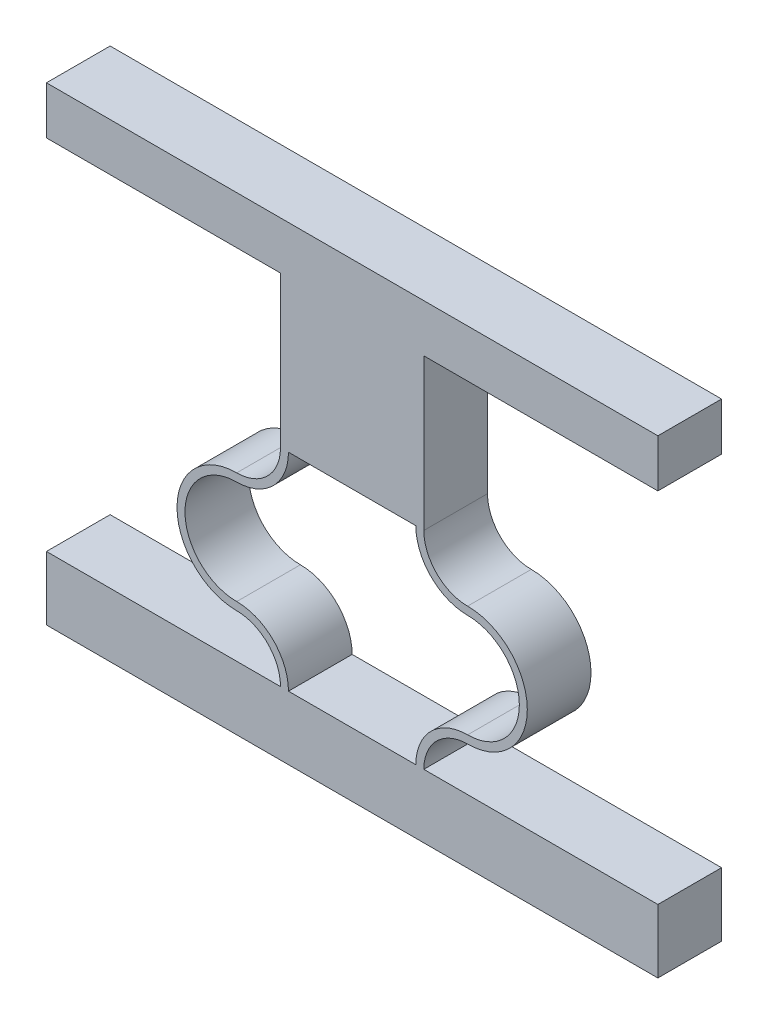
ISO-10303-21;
HEADER;
FILE_DESCRIPTION(('STEP AP214'),'2;1');
FILE_NAME('part.step','',(''),(''),'','','');
FILE_SCHEMA(('AUTOMOTIVE_DESIGN { 1 0 10303 214 1 1 1 1 }'));
ENDSEC;
DATA;
#1=APPLICATION_CONTEXT('core data for automotive mechanical design processes');
#2=APPLICATION_PROTOCOL_DEFINITION('international standard','automotive_design',2000,#1);
#3=PRODUCT_CONTEXT('',#1,'mechanical');
#4=PRODUCT('Part','Part','',(#3));
#5=PRODUCT_RELATED_PRODUCT_CATEGORY('part','',(#4));
#6=PRODUCT_DEFINITION_FORMATION('','',#4);
#7=PRODUCT_DEFINITION_CONTEXT('part definition',#1,'design');
#8=PRODUCT_DEFINITION('design','',#6,#7);
#9=PRODUCT_DEFINITION_SHAPE('','',#8);
#10=(LENGTH_UNIT() NAMED_UNIT(*) SI_UNIT(.MILLI.,.METRE.));
#11=(NAMED_UNIT(*) PLANE_ANGLE_UNIT() SI_UNIT($,.RADIAN.));
#12=(NAMED_UNIT(*) SI_UNIT($,.STERADIAN.) SOLID_ANGLE_UNIT());
#13=UNCERTAINTY_MEASURE_WITH_UNIT(LENGTH_MEASURE(1.E-05),#10,'distance_accuracy_value','');
#14=(GEOMETRIC_REPRESENTATION_CONTEXT(3) GLOBAL_UNCERTAINTY_ASSIGNED_CONTEXT((#13)) GLOBAL_UNIT_ASSIGNED_CONTEXT((#10,
#11,#12)) REPRESENTATION_CONTEXT('',''));
#15=CARTESIAN_POINT('',(0.,0.,0.));
#16=DIRECTION('',(0.,0.,1.));
#17=DIRECTION('',(1.,0.,0.));
#18=AXIS2_PLACEMENT_3D('',#15,#16,#17);
#19=CARTESIAN_POINT('',(13.4499998963409,13.,4.));
#20=DIRECTION('',(0.,0.,-1.));
#21=DIRECTION('',(-1.,0.,0.));
#22=AXIS2_PLACEMENT_3D('',#19,#20,#21);
#23=CYLINDRICAL_SURFACE('',#22,3.25);
#24=CARTESIAN_POINT('',(13.4499998963409,13.,0.));
#25=DIRECTION('',(0.,0.,1.));
#26=DIRECTION('',(1.,0.,0.));
#27=AXIS2_PLACEMENT_3D('',#24,#25,#26);
#28=CIRCLE('',#27,3.25);
#29=CARTESIAN_POINT('',(10.1999998963409,13.,0.));
#30=VERTEX_POINT('',#29);
#31=CARTESIAN_POINT('',(13.4499998963409,9.75,0.));
#32=VERTEX_POINT('',#31);
#33=EDGE_CURVE('E168',#30,#32,#28,.T.);
#34=ORIENTED_EDGE('',*,*,#33,.T.);
#35=DIRECTION('',(0.,0.,-1.));
#36=VECTOR('',#35,1.);
#37=CARTESIAN_POINT('',(13.4499998963409,9.75,4.));
#38=LINE('',#37,#36);
#39=CARTESIAN_POINT('',(13.4499998963409,9.75,4.));
#40=VERTEX_POINT('',#39);
#41=EDGE_CURVE('E152',#40,#32,#38,.T.);
#42=ORIENTED_EDGE('',*,*,#41,.F.);
#43=CARTESIAN_POINT('',(13.4499998963409,13.,4.));
#44=DIRECTION('',(0.,0.,1.));
#45=DIRECTION('',(1.,0.,0.));
#46=AXIS2_PLACEMENT_3D('',#43,#44,#45);
#47=CIRCLE('',#46,3.25);
#48=CARTESIAN_POINT('',(10.1999998963409,13.,4.));
#49=VERTEX_POINT('',#48);
#50=EDGE_CURVE('E156',#49,#40,#47,.T.);
#51=ORIENTED_EDGE('',*,*,#50,.F.);
#52=DIRECTION('',(0.,0.,-1.));
#53=VECTOR('',#52,1.);
#54=CARTESIAN_POINT('',(10.1999998963409,13.,4.));
#55=LINE('',#54,#53);
#56=EDGE_CURVE('E169',#49,#30,#55,.T.);
#57=ORIENTED_EDGE('',*,*,#56,.T.);
#58=EDGE_LOOP('',(#34,#42,#51,#57));
#59=FACE_BOUND('',#58,.T.);
#60=ADVANCED_FACE('F43',(#59),#23,.T.);
#61=CARTESIAN_POINT('',(13.4499998963409,6.5,4.));
#62=DIRECTION('',(0.,0.,-1.));
#63=DIRECTION('',(-1.,0.,0.));
#64=AXIS2_PLACEMENT_3D('',#61,#62,#63);
#65=CYLINDRICAL_SURFACE('',#64,3.25);
#66=CARTESIAN_POINT('',(13.4499998963409,6.5,0.));
#67=DIRECTION('',(0.,0.,1.));
#68=DIRECTION('',(1.,0.,0.));
#69=AXIS2_PLACEMENT_3D('',#66,#67,#68);
#70=CIRCLE('',#69,3.25);
#71=CARTESIAN_POINT('',(13.4499998963409,3.25,0.));
#72=VERTEX_POINT('',#71);
#73=EDGE_CURVE('E206',#32,#72,#70,.F.);
#74=ORIENTED_EDGE('',*,*,#73,.T.);
#75=DIRECTION('',(0.,0.,-1.));
#76=VECTOR('',#75,1.);
#77=CARTESIAN_POINT('',(13.4499998963409,3.25,4.));
#78=LINE('',#77,#76);
#79=CARTESIAN_POINT('',(13.4499998963409,3.25,4.));
#80=VERTEX_POINT('',#79);
#81=EDGE_CURVE('E154',#80,#72,#78,.T.);
#82=ORIENTED_EDGE('',*,*,#81,.F.);
#83=CARTESIAN_POINT('',(13.4499998963409,6.5,4.));
#84=DIRECTION('',(0.,0.,1.));
#85=DIRECTION('',(1.,0.,0.));
#86=AXIS2_PLACEMENT_3D('',#83,#84,#85);
#87=CIRCLE('',#86,3.25);
#88=EDGE_CURVE('E147',#40,#80,#87,.F.);
#89=ORIENTED_EDGE('',*,*,#88,.F.);
#90=ORIENTED_EDGE('',*,*,#41,.T.);
#91=EDGE_LOOP('',(#74,#82,#89,#90));
#92=FACE_BOUND('',#91,.T.);
#93=ADVANCED_FACE('F150',(#92),#65,.F.);
#94=CARTESIAN_POINT('',(13.4499998963409,0.,4.));
#95=DIRECTION('',(0.,0.,-1.));
#96=DIRECTION('',(-1.,0.,0.));
#97=AXIS2_PLACEMENT_3D('',#94,#95,#96);
#98=CYLINDRICAL_SURFACE('',#97,3.25);
#99=CARTESIAN_POINT('',(13.4499998963409,0.,0.));
#100=DIRECTION('',(0.,0.,1.));
#101=DIRECTION('',(1.,0.,0.));
#102=AXIS2_PLACEMENT_3D('',#99,#100,#101);
#103=CIRCLE('',#102,3.25);
#104=CARTESIAN_POINT('',(10.1999998963409,0.,0.));
#105=VERTEX_POINT('',#104);
#106=EDGE_CURVE('E204',#72,#105,#103,.T.);
#107=ORIENTED_EDGE('',*,*,#106,.T.);
#108=DIRECTION('',(0.,0.,-1.));
#109=VECTOR('',#108,1.);
#110=CARTESIAN_POINT('',(10.1999998963409,0.,4.));
#111=LINE('',#110,#109);
#112=CARTESIAN_POINT('',(10.1999998963409,0.,4.));
#113=VERTEX_POINT('',#112);
#114=EDGE_CURVE('E190',#113,#105,#111,.T.);
#115=ORIENTED_EDGE('',*,*,#114,.F.);
#116=CARTESIAN_POINT('',(13.4499998963409,0.,4.));
#117=DIRECTION('',(0.,0.,1.));
#118=DIRECTION('',(1.,0.,0.));
#119=AXIS2_PLACEMENT_3D('',#116,#117,#118);
#120=CIRCLE('',#119,3.25);
#121=EDGE_CURVE('E141',#80,#113,#120,.T.);
#122=ORIENTED_EDGE('',*,*,#121,.F.);
#123=ORIENTED_EDGE('',*,*,#81,.T.);
#124=EDGE_LOOP('',(#107,#115,#122,#123));
#125=FACE_BOUND('',#124,.T.);
#126=ADVANCED_FACE('F373',(#125),#98,.T.);
#127=CARTESIAN_POINT('',(0.,-4.00000000000024,4.));
#128=DIRECTION('',(0.,1.,0.));
#129=DIRECTION('',(-1.,0.,0.));
#130=AXIS2_PLACEMENT_3D('',#127,#128,#129);
#131=PLANE('',#130);
#132=DIRECTION('',(1.,0.,0.));
#133=VECTOR('',#132,1.);
#134=CARTESIAN_POINT('',(0.,-4.00000000000024,4.));
#135=LINE('',#134,#133);
#136=CARTESIAN_POINT('',(-13.0000002126815,-4.00000000000024,4.));
#137=VERTEX_POINT('',#136);
#138=CARTESIAN_POINT('',(25.4000000053633,-4.00000000000024,4.));
#139=VERTEX_POINT('',#138);
#140=EDGE_CURVE('E213',#137,#139,#135,.T.);
#141=ORIENTED_EDGE('',*,*,#140,.F.);
#142=DIRECTION('',(0.,0.,-1.));
#143=VECTOR('',#142,1.);
#144=CARTESIAN_POINT('',(-13.0000002126815,-4.00000000000024,4.));
#145=LINE('',#144,#143);
#146=CARTESIAN_POINT('',(-13.0000002126815,-4.00000000000024,0.));
#147=VERTEX_POINT('',#146);
#148=EDGE_CURVE('E239',#137,#147,#145,.T.);
#149=ORIENTED_EDGE('',*,*,#148,.T.);
#150=DIRECTION('',(1.,0.,0.));
#151=VECTOR('',#150,1.);
#152=CARTESIAN_POINT('',(0.,-4.00000000000024,0.));
#153=LINE('',#152,#151);
#154=CARTESIAN_POINT('',(25.4000000053633,-4.00000000000024,0.));
#155=VERTEX_POINT('',#154);
#156=EDGE_CURVE('E194',#147,#155,#153,.T.);
#157=ORIENTED_EDGE('',*,*,#156,.T.);
#158=DIRECTION('',(0.,0.,-1.));
#159=VECTOR('',#158,1.);
#160=CARTESIAN_POINT('',(25.4000000053633,-4.00000000000024,4.));
#161=LINE('',#160,#159);
#162=EDGE_CURVE('E183',#139,#155,#161,.T.);
#163=ORIENTED_EDGE('',*,*,#162,.F.);
#164=EDGE_LOOP('',(#141,#149,#157,#163));
#165=FACE_BOUND('',#164,.T.);
#166=ADVANCED_FACE('F236',(#165),#131,.F.);
#167=CARTESIAN_POINT('',(25.4000000053633,0.,4.));
#168=DIRECTION('',(-1.,0.,0.));
#169=DIRECTION('',(0.,-1.,0.));
#170=AXIS2_PLACEMENT_3D('',#167,#168,#169);
#171=PLANE('',#170);
#172=DIRECTION('',(0.,1.,0.));
#173=VECTOR('',#172,1.);
#174=CARTESIAN_POINT('',(25.4000000053633,0.,0.));
#175=LINE('',#174,#173);
#176=CARTESIAN_POINT('',(25.4000000053633,0.,0.));
#177=VERTEX_POINT('',#176);
#178=EDGE_CURVE('E191',#155,#177,#175,.T.);
#179=ORIENTED_EDGE('',*,*,#178,.T.);
#180=DIRECTION('',(0.,0.,1.));
#181=VECTOR('',#180,1.);
#182=CARTESIAN_POINT('',(25.4000000053633,0.,0.));
#183=LINE('',#182,#181);
#184=CARTESIAN_POINT('',(25.4000000053633,0.,4.));
#185=VERTEX_POINT('',#184);
#186=EDGE_CURVE('E248',#177,#185,#183,.T.);
#187=ORIENTED_EDGE('',*,*,#186,.T.);
#188=DIRECTION('',(0.,1.,0.));
#189=VECTOR('',#188,1.);
#190=CARTESIAN_POINT('',(25.4000000053633,0.,4.));
#191=LINE('',#190,#189);
#192=EDGE_CURVE('E171',#139,#185,#191,.T.);
#193=ORIENTED_EDGE('',*,*,#192,.F.);
#194=ORIENTED_EDGE('',*,*,#162,.T.);
#195=EDGE_LOOP('',(#179,#187,#193,#194));
#196=FACE_BOUND('',#195,.T.);
#197=ADVANCED_FACE('F246',(#196),#171,.F.);
#198=CARTESIAN_POINT('',(10.7000142238188,0.,4.));
#199=DIRECTION('',(-1.,0.,0.));
#200=DIRECTION('',(0.,-1.,0.));
#201=AXIS2_PLACEMENT_3D('',#198,#199,#200);
#202=PLANE('',#201);
#203=DIRECTION('',(0.,1.,0.));
#204=VECTOR('',#203,1.);
#205=CARTESIAN_POINT('',(10.7000142238188,0.,0.));
#206=LINE('',#205,#204);
#207=CARTESIAN_POINT('',(10.7000142238188,12.9911230115913,0.));
#208=VERTEX_POINT('',#207);
#209=CARTESIAN_POINT('',(10.7000142238188,22.4911230115913,0.));
#210=VERTEX_POINT('',#209);
#211=EDGE_CURVE('E52',#208,#210,#206,.T.);
#212=ORIENTED_EDGE('',*,*,#211,.T.);
#213=DIRECTION('',(0.,0.,-1.));
#214=VECTOR('',#213,1.);
#215=CARTESIAN_POINT('',(10.7000142238188,22.4911230115913,4.));
#216=LINE('',#215,#214);
#217=CARTESIAN_POINT('',(10.7000142238188,22.4911230115913,4.));
#218=VERTEX_POINT('',#217);
#219=EDGE_CURVE('E13',#218,#210,#216,.T.);
#220=ORIENTED_EDGE('',*,*,#219,.F.);
#221=DIRECTION('',(0.,1.,0.));
#222=VECTOR('',#221,1.);
#223=CARTESIAN_POINT('',(10.7000142238188,0.,4.));
#224=LINE('',#223,#222);
#225=CARTESIAN_POINT('',(10.7000142238188,12.9911230115913,4.));
#226=VERTEX_POINT('',#225);
#227=EDGE_CURVE('E68',#226,#218,#224,.T.);
#228=ORIENTED_EDGE('',*,*,#227,.F.);
#229=DIRECTION('',(0.,0.,-1.));
#230=VECTOR('',#229,1.);
#231=CARTESIAN_POINT('',(10.7000142238188,12.9911230115913,4.));
#232=LINE('',#231,#230);
#233=EDGE_CURVE('E179',#226,#208,#232,.T.);
#234=ORIENTED_EDGE('',*,*,#233,.T.);
#235=EDGE_LOOP('',(#212,#220,#228,#234));
#236=FACE_BOUND('',#235,.T.);
#237=ADVANCED_FACE('F492',(#236),#202,.F.);
#238=CARTESIAN_POINT('',(0.,0.,4.));
#239=DIRECTION('',(0.,1.,0.));
#240=DIRECTION('',(-1.,0.,0.));
#241=AXIS2_PLACEMENT_3D('',#238,#239,#240);
#242=PLANE('',#241);
#243=DIRECTION('',(1.,0.,0.));
#244=VECTOR('',#243,1.);
#245=CARTESIAN_POINT('',(0.,0.,0.));
#246=LINE('',#245,#244);
#247=CARTESIAN_POINT('',(10.6999998963409,0.,0.));
#248=VERTEX_POINT('',#247);
#249=EDGE_CURVE('E59',#248,#177,#246,.T.);
#250=ORIENTED_EDGE('',*,*,#249,.F.);
#251=DIRECTION('',(0.,0.,-1.));
#252=VECTOR('',#251,1.);
#253=CARTESIAN_POINT('',(10.6999998963409,0.,4.));
#254=LINE('',#253,#252);
#255=CARTESIAN_POINT('',(10.6999998963409,0.,4.));
#256=VERTEX_POINT('',#255);
#257=EDGE_CURVE('E182',#256,#248,#254,.T.);
#258=ORIENTED_EDGE('',*,*,#257,.F.);
#259=DIRECTION('',(1.,0.,0.));
#260=VECTOR('',#259,1.);
#261=CARTESIAN_POINT('',(0.,0.,4.));
#262=LINE('',#261,#260);
#263=EDGE_CURVE('E220',#256,#185,#262,.T.);
#264=ORIENTED_EDGE('',*,*,#263,.T.);
#265=ORIENTED_EDGE('',*,*,#186,.F.);
#266=EDGE_LOOP('',(#250,#258,#264,#265));
#267=FACE_BOUND('',#266,.T.);
#268=ADVANCED_FACE('F503',(#267),#242,.T.);
#269=CARTESIAN_POINT('',(13.4499998963409,0.,4.));
#270=DIRECTION('',(0.,0.,-1.));
#271=DIRECTION('',(-1.,0.,0.));
#272=AXIS2_PLACEMENT_3D('',#269,#270,#271);
#273=CYLINDRICAL_SURFACE('',#272,2.75);
#274=CARTESIAN_POINT('',(13.4499998963409,0.,0.));
#275=DIRECTION('',(0.,0.,1.));
#276=DIRECTION('',(1.,0.,0.));
#277=AXIS2_PLACEMENT_3D('',#274,#275,#276);
#278=CIRCLE('',#277,2.75);
#279=CARTESIAN_POINT('',(13.4499998963409,2.75,0.));
#280=VERTEX_POINT('',#279);
#281=EDGE_CURVE('E198',#280,#248,#278,.T.);
#282=ORIENTED_EDGE('',*,*,#281,.F.);
#283=DIRECTION('',(0.,0.,-1.));
#284=VECTOR('',#283,1.);
#285=CARTESIAN_POINT('',(13.4499998963409,2.75,4.));
#286=LINE('',#285,#284);
#287=CARTESIAN_POINT('',(13.4499998963409,2.75,4.));
#288=VERTEX_POINT('',#287);
#289=EDGE_CURVE('E185',#288,#280,#286,.T.);
#290=ORIENTED_EDGE('',*,*,#289,.F.);
#291=CARTESIAN_POINT('',(13.4499998963409,0.,4.));
#292=DIRECTION('',(0.,0.,1.));
#293=DIRECTION('',(1.,0.,0.));
#294=AXIS2_PLACEMENT_3D('',#291,#292,#293);
#295=CIRCLE('',#294,2.75);
#296=EDGE_CURVE('E217',#288,#256,#295,.T.);
#297=ORIENTED_EDGE('',*,*,#296,.T.);
#298=ORIENTED_EDGE('',*,*,#257,.T.);
#299=EDGE_LOOP('',(#282,#290,#297,#298));
#300=FACE_BOUND('',#299,.T.);
#301=ADVANCED_FACE('F502',(#300),#273,.F.);
#302=CARTESIAN_POINT('',(13.4499998963409,6.5,4.));
#303=DIRECTION('',(0.,0.,-1.));
#304=DIRECTION('',(-1.,0.,0.));
#305=AXIS2_PLACEMENT_3D('',#302,#303,#304);
#306=CYLINDRICAL_SURFACE('',#305,3.75);
#307=CARTESIAN_POINT('',(13.4499998963409,6.5,0.));
#308=DIRECTION('',(0.,0.,1.));
#309=DIRECTION('',(1.,0.,0.));
#310=AXIS2_PLACEMENT_3D('',#307,#308,#309);
#311=CIRCLE('',#310,3.75);
#312=CARTESIAN_POINT('',(13.4499998963409,10.25,0.));
#313=VERTEX_POINT('',#312);
#314=EDGE_CURVE('E195',#313,#280,#311,.F.);
#315=ORIENTED_EDGE('',*,*,#314,.F.);
#316=DIRECTION('',(0.,0.,-1.));
#317=VECTOR('',#316,1.);
#318=CARTESIAN_POINT('',(13.4499998963409,10.25,4.));
#319=LINE('',#318,#317);
#320=CARTESIAN_POINT('',(13.4499998963409,10.25,4.));
#321=VERTEX_POINT('',#320);
#322=EDGE_CURVE('E173',#321,#313,#319,.T.);
#323=ORIENTED_EDGE('',*,*,#322,.F.);
#324=CARTESIAN_POINT('',(13.4499998963409,6.5,4.));
#325=DIRECTION('',(0.,0.,1.));
#326=DIRECTION('',(1.,0.,0.));
#327=AXIS2_PLACEMENT_3D('',#324,#325,#326);
#328=CIRCLE('',#327,3.75);
#329=EDGE_CURVE('E214',#321,#288,#328,.F.);
#330=ORIENTED_EDGE('',*,*,#329,.T.);
#331=ORIENTED_EDGE('',*,*,#289,.T.);
#332=EDGE_LOOP('',(#315,#323,#330,#331));
#333=FACE_BOUND('',#332,.T.);
#334=ADVANCED_FACE('F498',(#333),#306,.T.);
#335=CARTESIAN_POINT('',(13.4499998963409,13.,4.));
#336=DIRECTION('',(0.,0.,-1.));
#337=DIRECTION('',(-1.,0.,0.));
#338=AXIS2_PLACEMENT_3D('',#335,#336,#337);
#339=CYLINDRICAL_SURFACE('',#338,2.75);
#340=CARTESIAN_POINT('',(13.4499998963409,13.,0.));
#341=DIRECTION('',(0.,0.,1.));
#342=DIRECTION('',(1.,0.,0.));
#343=AXIS2_PLACEMENT_3D('',#340,#341,#342);
#344=CIRCLE('',#343,2.75);
#345=EDGE_CURVE('E201',#208,#313,#344,.T.);
#346=ORIENTED_EDGE('',*,*,#345,.F.);
#347=ORIENTED_EDGE('',*,*,#233,.F.);
#348=CARTESIAN_POINT('',(13.4499998963409,13.,4.));
#349=DIRECTION('',(0.,0.,1.));
#350=DIRECTION('',(1.,0.,0.));
#351=AXIS2_PLACEMENT_3D('',#348,#349,#350);
#352=CIRCLE('',#351,2.75);
#353=EDGE_CURVE('E223',#226,#321,#352,.T.);
#354=ORIENTED_EDGE('',*,*,#353,.T.);
#355=ORIENTED_EDGE('',*,*,#322,.T.);
#356=EDGE_LOOP('',(#346,#347,#354,#355));
#357=FACE_BOUND('',#356,.T.);
#358=ADVANCED_FACE('F522',(#357),#339,.F.);
#359=CARTESIAN_POINT('',(0.,0.,4.));
#360=DIRECTION('',(0.,0.,1.));
#361=DIRECTION('',(1.,0.,0.));
#362=AXIS2_PLACEMENT_3D('',#359,#360,#361);
#363=PLANE('',#362);
#364=DIRECTION('',(-1.,0.,0.));
#365=VECTOR('',#364,1.);
#366=CARTESIAN_POINT('',(12.3999997926818,0.,4.));
#367=LINE('',#366,#365);
#368=CARTESIAN_POINT('',(1.6999998963409,0.,4.));
#369=VERTEX_POINT('',#368);
#370=CARTESIAN_POINT('',(-13.0000002126814,0.,4.));
#371=VERTEX_POINT('',#370);
#372=EDGE_CURVE('E388',#369,#371,#367,.T.);
#373=ORIENTED_EDGE('',*,*,#372,.T.);
#374=DIRECTION('',(0.,1.,0.));
#375=VECTOR('',#374,1.);
#376=CARTESIAN_POINT('',(-13.0000002126815,0.,4.));
#377=LINE('',#376,#375);
#378=EDGE_CURVE('E381',#137,#371,#377,.T.);
#379=ORIENTED_EDGE('',*,*,#378,.F.);
#380=ORIENTED_EDGE('',*,*,#140,.T.);
#381=ORIENTED_EDGE('',*,*,#192,.T.);
#382=ORIENTED_EDGE('',*,*,#263,.F.);
#383=ORIENTED_EDGE('',*,*,#296,.F.);
#384=ORIENTED_EDGE('',*,*,#329,.F.);
#385=ORIENTED_EDGE('',*,*,#353,.F.);
#386=ORIENTED_EDGE('',*,*,#227,.T.);
#387=DIRECTION('',(1.,0.,0.));
#388=VECTOR('',#387,1.);
#389=CARTESIAN_POINT('',(-13.0000002126815,22.4911230115913,4.));
#390=LINE('',#389,#388);
#391=CARTESIAN_POINT('',(25.4000000053633,22.4911230115913,4.));
#392=VERTEX_POINT('',#391);
#393=EDGE_CURVE('E474',#218,#392,#390,.T.);
#394=ORIENTED_EDGE('',*,*,#393,.T.);
#395=DIRECTION('',(0.,1.,0.));
#396=VECTOR('',#395,1.);
#397=CARTESIAN_POINT('',(25.4000000053633,25.4911230115913,4.));
#398=LINE('',#397,#396);
#399=CARTESIAN_POINT('',(25.4000000053633,25.4911230115913,4.));
#400=VERTEX_POINT('',#399);
#401=EDGE_CURVE('E470',#392,#400,#398,.T.);
#402=ORIENTED_EDGE('',*,*,#401,.T.);
#403=DIRECTION('',(-1.,0.,0.));
#404=VECTOR('',#403,1.);
#405=CARTESIAN_POINT('',(-13.0000002126815,25.4911230115913,4.));
#406=LINE('',#405,#404);
#407=CARTESIAN_POINT('',(-13.0000002126815,25.4911230115913,4.));
#408=VERTEX_POINT('',#407);
#409=EDGE_CURVE('E460',#400,#408,#406,.T.);
#410=ORIENTED_EDGE('',*,*,#409,.T.);
#411=DIRECTION('',(0.,-1.,0.));
#412=VECTOR('',#411,1.);
#413=CARTESIAN_POINT('',(-13.0000002126815,25.4911230115913,4.));
#414=LINE('',#413,#412);
#415=CARTESIAN_POINT('',(-13.0000002126815,22.4911230115913,4.));
#416=VERTEX_POINT('',#415);
#417=EDGE_CURVE('E475',#408,#416,#414,.T.);
#418=ORIENTED_EDGE('',*,*,#417,.T.);
#419=CARTESIAN_POINT('',(1.69998556886301,22.4911230115913,4.));
#420=VERTEX_POINT('',#419);
#421=EDGE_CURVE('E442',#416,#420,#390,.T.);
#422=ORIENTED_EDGE('',*,*,#421,.T.);
#423=DIRECTION('',(0.,1.,0.));
#424=VECTOR('',#423,1.);
#425=CARTESIAN_POINT('',(1.69998556886302,0.,4.));
#426=LINE('',#425,#424);
#427=CARTESIAN_POINT('',(1.69998556886301,12.9911230116086,4.));
#428=VERTEX_POINT('',#427);
#429=EDGE_CURVE('E352',#428,#420,#426,.T.);
#430=ORIENTED_EDGE('',*,*,#429,.F.);
#431=CARTESIAN_POINT('',(-1.0500001036591,13.,4.));
#432=DIRECTION('',(0.,0.,-1.));
#433=DIRECTION('',(-1.,0.,0.));
#434=AXIS2_PLACEMENT_3D('',#431,#432,#433);
#435=CIRCLE('',#434,2.75);
#436=CARTESIAN_POINT('',(-1.0500001036591,10.25,4.));
#437=VERTEX_POINT('',#436);
#438=EDGE_CURVE('E390',#428,#437,#435,.T.);
#439=ORIENTED_EDGE('',*,*,#438,.T.);
#440=CARTESIAN_POINT('',(-1.0500001036591,6.5,4.));
#441=DIRECTION('',(0.,0.,-1.));
#442=DIRECTION('',(-1.,0.,0.));
#443=AXIS2_PLACEMENT_3D('',#440,#441,#442);
#444=CIRCLE('',#443,3.75);
#445=CARTESIAN_POINT('',(-1.0500001036591,2.75,4.));
#446=VERTEX_POINT('',#445);
#447=EDGE_CURVE('E384',#437,#446,#444,.F.);
#448=ORIENTED_EDGE('',*,*,#447,.T.);
#449=CARTESIAN_POINT('',(-1.0500001036591,0.,4.));
#450=DIRECTION('',(0.,0.,-1.));
#451=DIRECTION('',(-1.,0.,0.));
#452=AXIS2_PLACEMENT_3D('',#449,#450,#451);
#453=CIRCLE('',#452,2.75);
#454=EDGE_CURVE('E386',#446,#369,#453,.T.);
#455=ORIENTED_EDGE('',*,*,#454,.T.);
#456=EDGE_LOOP('',(#373,#379,#380,#381,#382,#383,#384,#385,#386,#394,#402,#410,#418,#422,#430,
#439,#448,#455));
#457=FACE_BOUND('',#456,.T.);
#458=DIRECTION('',(1.,0.,0.));
#459=VECTOR('',#458,1.);
#460=CARTESIAN_POINT('',(6.19999989634091,0.,4.));
#461=LINE('',#460,#459);
#462=CARTESIAN_POINT('',(2.19999989634091,0.,4.));
#463=VERTEX_POINT('',#462);
#464=EDGE_CURVE('E365',#463,#113,#461,.T.);
#465=ORIENTED_EDGE('',*,*,#464,.F.);
#466=CARTESIAN_POINT('',(-1.0500001036591,0.,4.));
#467=DIRECTION('',(0.,0.,-1.));
#468=DIRECTION('',(-1.,0.,0.));
#469=AXIS2_PLACEMENT_3D('',#466,#467,#468);
#470=CIRCLE('',#469,3.25);
#471=CARTESIAN_POINT('',(-1.0500001036591,3.25,4.));
#472=VERTEX_POINT('',#471);
#473=EDGE_CURVE('E329',#472,#463,#470,.T.);
#474=ORIENTED_EDGE('',*,*,#473,.F.);
#475=CARTESIAN_POINT('',(-1.0500001036591,6.5,4.));
#476=DIRECTION('',(0.,0.,-1.));
#477=DIRECTION('',(-1.,0.,0.));
#478=AXIS2_PLACEMENT_3D('',#475,#476,#477);
#479=CIRCLE('',#478,3.25);
#480=CARTESIAN_POINT('',(-1.0500001036591,9.75,4.));
#481=VERTEX_POINT('',#480);
#482=EDGE_CURVE('E332',#481,#472,#479,.F.);
#483=ORIENTED_EDGE('',*,*,#482,.F.);
#484=CARTESIAN_POINT('',(-1.0500001036591,13.,4.));
#485=DIRECTION('',(0.,0.,-1.));
#486=DIRECTION('',(-1.,0.,0.));
#487=AXIS2_PLACEMENT_3D('',#484,#485,#486);
#488=CIRCLE('',#487,3.25);
#489=CARTESIAN_POINT('',(2.19999989634091,13.,4.));
#490=VERTEX_POINT('',#489);
#491=EDGE_CURVE('E335',#490,#481,#488,.T.);
#492=ORIENTED_EDGE('',*,*,#491,.F.);
#493=DIRECTION('',(1.,0.,0.));
#494=VECTOR('',#493,1.);
#495=CARTESIAN_POINT('',(6.19999989634091,13.,4.));
#496=LINE('',#495,#494);
#497=EDGE_CURVE('E164',#490,#49,#496,.T.);
#498=ORIENTED_EDGE('',*,*,#497,.T.);
#499=ORIENTED_EDGE('',*,*,#50,.T.);
#500=ORIENTED_EDGE('',*,*,#88,.T.);
#501=ORIENTED_EDGE('',*,*,#121,.T.);
#502=EDGE_LOOP('',(#465,#474,#483,#492,#498,#499,#500,#501));
#503=FACE_BOUND('',#502,.T.);
#504=ADVANCED_FACE('F161',(#457,#503),#363,.T.);
#505=CARTESIAN_POINT('',(0.,0.,0.));
#506=DIRECTION('',(0.,0.,1.));
#507=DIRECTION('',(1.,0.,0.));
#508=AXIS2_PLACEMENT_3D('',#505,#506,#507);
#509=PLANE('',#508);
#510=DIRECTION('',(0.,1.,0.));
#511=VECTOR('',#510,1.);
#512=CARTESIAN_POINT('',(-13.0000002126815,0.,0.));
#513=LINE('',#512,#511);
#514=CARTESIAN_POINT('',(-13.0000002126814,0.,0.));
#515=VERTEX_POINT('',#514);
#516=EDGE_CURVE('E354',#147,#515,#513,.T.);
#517=ORIENTED_EDGE('',*,*,#516,.T.);
#518=DIRECTION('',(-1.,0.,0.));
#519=VECTOR('',#518,1.);
#520=CARTESIAN_POINT('',(12.3999997926818,0.,0.));
#521=LINE('',#520,#519);
#522=CARTESIAN_POINT('',(1.6999998963409,0.,0.));
#523=VERTEX_POINT('',#522);
#524=EDGE_CURVE('E413',#523,#515,#521,.T.);
#525=ORIENTED_EDGE('',*,*,#524,.F.);
#526=CARTESIAN_POINT('',(-1.0500001036591,0.,0.));
#527=DIRECTION('',(0.,0.,-1.));
#528=DIRECTION('',(-1.,0.,0.));
#529=AXIS2_PLACEMENT_3D('',#526,#527,#528);
#530=CIRCLE('',#529,2.75);
#531=CARTESIAN_POINT('',(-1.0500001036591,2.75,0.));
#532=VERTEX_POINT('',#531);
#533=EDGE_CURVE('E411',#532,#523,#530,.T.);
#534=ORIENTED_EDGE('',*,*,#533,.F.);
#535=CARTESIAN_POINT('',(-1.0500001036591,6.5,0.));
#536=DIRECTION('',(0.,0.,-1.));
#537=DIRECTION('',(-1.,0.,0.));
#538=AXIS2_PLACEMENT_3D('',#535,#536,#537);
#539=CIRCLE('',#538,3.75);
#540=CARTESIAN_POINT('',(-1.0500001036591,10.25,0.));
#541=VERTEX_POINT('',#540);
#542=EDGE_CURVE('E409',#541,#532,#539,.F.);
#543=ORIENTED_EDGE('',*,*,#542,.F.);
#544=CARTESIAN_POINT('',(-1.0500001036591,13.,0.));
#545=DIRECTION('',(0.,0.,-1.));
#546=DIRECTION('',(-1.,0.,0.));
#547=AXIS2_PLACEMENT_3D('',#544,#545,#546);
#548=CIRCLE('',#547,2.75);
#549=CARTESIAN_POINT('',(1.699985568863,12.9911230115913,0.));
#550=VERTEX_POINT('',#549);
#551=EDGE_CURVE('E416',#550,#541,#548,.T.);
#552=ORIENTED_EDGE('',*,*,#551,.F.);
#553=DIRECTION('',(0.,1.,0.));
#554=VECTOR('',#553,1.);
#555=CARTESIAN_POINT('',(1.69998556886302,0.,0.));
#556=LINE('',#555,#554);
#557=CARTESIAN_POINT('',(1.69998556886301,22.4911230115913,0.));
#558=VERTEX_POINT('',#557);
#559=EDGE_CURVE('E86',#550,#558,#556,.T.);
#560=ORIENTED_EDGE('',*,*,#559,.T.);
#561=DIRECTION('',(-1.,0.,0.));
#562=VECTOR('',#561,1.);
#563=CARTESIAN_POINT('',(-13.0000002126815,22.4911230115913,0.));
#564=LINE('',#563,#562);
#565=CARTESIAN_POINT('',(-13.0000002126815,22.4911230115913,0.));
#566=VERTEX_POINT('',#565);
#567=EDGE_CURVE('E449',#558,#566,#564,.T.);
#568=ORIENTED_EDGE('',*,*,#567,.T.);
#569=DIRECTION('',(0.,1.,0.));
#570=VECTOR('',#569,1.);
#571=CARTESIAN_POINT('',(-13.0000002126815,25.4911230115913,0.));
#572=LINE('',#571,#570);
#573=CARTESIAN_POINT('',(-13.0000002126815,25.4911230115913,0.));
#574=VERTEX_POINT('',#573);
#575=EDGE_CURVE('E453',#566,#574,#572,.T.);
#576=ORIENTED_EDGE('',*,*,#575,.T.);
#577=DIRECTION('',(1.,0.,0.));
#578=VECTOR('',#577,1.);
#579=CARTESIAN_POINT('',(-13.0000002126815,25.4911230115913,0.));
#580=LINE('',#579,#578);
#581=CARTESIAN_POINT('',(25.4000000053633,25.4911230115913,0.));
#582=VERTEX_POINT('',#581);
#583=EDGE_CURVE('E455',#574,#582,#580,.T.);
#584=ORIENTED_EDGE('',*,*,#583,.T.);
#585=DIRECTION('',(0.,-1.,0.));
#586=VECTOR('',#585,1.);
#587=CARTESIAN_POINT('',(25.4000000053633,25.4911230115913,0.));
#588=LINE('',#587,#586);
#589=CARTESIAN_POINT('',(25.4000000053633,22.4911230115913,0.));
#590=VERTEX_POINT('',#589);
#591=EDGE_CURVE('E467',#582,#590,#588,.T.);
#592=ORIENTED_EDGE('',*,*,#591,.T.);
#593=EDGE_CURVE('E363',#590,#210,#564,.T.);
#594=ORIENTED_EDGE('',*,*,#593,.T.);
#595=ORIENTED_EDGE('',*,*,#211,.F.);
#596=ORIENTED_EDGE('',*,*,#345,.T.);
#597=ORIENTED_EDGE('',*,*,#314,.T.);
#598=ORIENTED_EDGE('',*,*,#281,.T.);
#599=ORIENTED_EDGE('',*,*,#249,.T.);
#600=ORIENTED_EDGE('',*,*,#178,.F.);
#601=ORIENTED_EDGE('',*,*,#156,.F.);
#602=EDGE_LOOP('',(#517,#525,#534,#543,#552,#560,#568,#576,#584,#592,#594,#595,#596,#597,#598,
#599,#600,#601));
#603=FACE_BOUND('',#602,.T.);
#604=ORIENTED_EDGE('',*,*,#33,.F.);
#605=DIRECTION('',(1.,0.,0.));
#606=VECTOR('',#605,1.);
#607=CARTESIAN_POINT('',(6.19999989634091,13.,0.));
#608=LINE('',#607,#606);
#609=CARTESIAN_POINT('',(2.19999989634091,13.,0.));
#610=VERTEX_POINT('',#609);
#611=EDGE_CURVE('E95',#610,#30,#608,.T.);
#612=ORIENTED_EDGE('',*,*,#611,.F.);
#613=CARTESIAN_POINT('',(-1.0500001036591,13.,0.));
#614=DIRECTION('',(0.,0.,-1.));
#615=DIRECTION('',(-1.,0.,0.));
#616=AXIS2_PLACEMENT_3D('',#613,#614,#615);
#617=CIRCLE('',#616,3.25);
#618=CARTESIAN_POINT('',(-1.0500001036591,9.75,0.));
#619=VERTEX_POINT('',#618);
#620=EDGE_CURVE('E374',#610,#619,#617,.T.);
#621=ORIENTED_EDGE('',*,*,#620,.T.);
#622=CARTESIAN_POINT('',(-1.0500001036591,6.5,0.));
#623=DIRECTION('',(0.,0.,-1.));
#624=DIRECTION('',(-1.,0.,0.));
#625=AXIS2_PLACEMENT_3D('',#622,#623,#624);
#626=CIRCLE('',#625,3.25);
#627=CARTESIAN_POINT('',(-1.0500001036591,3.25,0.));
#628=VERTEX_POINT('',#627);
#629=EDGE_CURVE('E344',#619,#628,#626,.F.);
#630=ORIENTED_EDGE('',*,*,#629,.T.);
#631=CARTESIAN_POINT('',(-1.0500001036591,0.,0.));
#632=DIRECTION('',(0.,0.,-1.));
#633=DIRECTION('',(-1.,0.,0.));
#634=AXIS2_PLACEMENT_3D('',#631,#632,#633);
#635=CIRCLE('',#634,3.25);
#636=CARTESIAN_POINT('',(2.19999989634091,0.,0.));
#637=VERTEX_POINT('',#636);
#638=EDGE_CURVE('E371',#628,#637,#635,.T.);
#639=ORIENTED_EDGE('',*,*,#638,.T.);
#640=DIRECTION('',(1.,0.,0.));
#641=VECTOR('',#640,1.);
#642=CARTESIAN_POINT('',(6.19999989634091,0.,0.));
#643=LINE('',#642,#641);
#644=EDGE_CURVE('E176',#637,#105,#643,.T.);
#645=ORIENTED_EDGE('',*,*,#644,.T.);
#646=ORIENTED_EDGE('',*,*,#106,.F.);
#647=ORIENTED_EDGE('',*,*,#73,.F.);
#648=EDGE_LOOP('',(#604,#612,#621,#630,#639,#645,#646,#647));
#649=FACE_BOUND('',#648,.T.);
#650=ADVANCED_FACE('F45',(#603,#649),#509,.F.);
#651=CARTESIAN_POINT('',(6.19999989634091,0.,0.));
#652=DIRECTION('',(0.,-1.,0.));
#653=DIRECTION('',(0.,0.,-1.));
#654=AXIS2_PLACEMENT_3D('',#651,#652,#653);
#655=PLANE('',#654);
#656=ORIENTED_EDGE('',*,*,#114,.T.);
#657=ORIENTED_EDGE('',*,*,#644,.F.);
#658=DIRECTION('',(0.,0.,-1.));
#659=VECTOR('',#658,1.);
#660=CARTESIAN_POINT('',(2.19999989634091,0.,4.));
#661=LINE('',#660,#659);
#662=EDGE_CURVE('E360',#463,#637,#661,.T.);
#663=ORIENTED_EDGE('',*,*,#662,.F.);
#664=ORIENTED_EDGE('',*,*,#464,.T.);
#665=EDGE_LOOP('',(#656,#657,#663,#664));
#666=FACE_BOUND('',#665,.T.);
#667=ADVANCED_FACE('F372',(#666),#655,.F.);
#668=CARTESIAN_POINT('',(6.19999989634091,13.,0.));
#669=DIRECTION('',(0.,1.,0.));
#670=DIRECTION('',(0.,0.,1.));
#671=AXIS2_PLACEMENT_3D('',#668,#669,#670);
#672=PLANE('',#671);
#673=ORIENTED_EDGE('',*,*,#56,.F.);
#674=ORIENTED_EDGE('',*,*,#497,.F.);
#675=DIRECTION('',(0.,0.,-1.));
#676=VECTOR('',#675,1.);
#677=CARTESIAN_POINT('',(2.19999989634091,13.,4.));
#678=LINE('',#677,#676);
#679=EDGE_CURVE('E349',#490,#610,#678,.T.);
#680=ORIENTED_EDGE('',*,*,#679,.T.);
#681=ORIENTED_EDGE('',*,*,#611,.T.);
#682=EDGE_LOOP('',(#673,#674,#680,#681));
#683=FACE_BOUND('',#682,.T.);
#684=ADVANCED_FACE('F375',(#683),#672,.F.);
#685=CARTESIAN_POINT('',(-1.0500001036591,13.,4.));
#686=DIRECTION('',(0.,0.,-1.));
#687=DIRECTION('',(1.,0.,0.));
#688=AXIS2_PLACEMENT_3D('',#685,#686,#687);
#689=CYLINDRICAL_SURFACE('',#688,3.25);
#690=ORIENTED_EDGE('',*,*,#620,.F.);
#691=ORIENTED_EDGE('',*,*,#679,.F.);
#692=ORIENTED_EDGE('',*,*,#491,.T.);
#693=DIRECTION('',(0.,0.,-1.));
#694=VECTOR('',#693,1.);
#695=CARTESIAN_POINT('',(-1.0500001036591,9.75,4.));
#696=LINE('',#695,#694);
#697=EDGE_CURVE('E341',#481,#619,#696,.T.);
#698=ORIENTED_EDGE('',*,*,#697,.T.);
#699=EDGE_LOOP('',(#690,#691,#692,#698));
#700=FACE_BOUND('',#699,.T.);
#701=ADVANCED_FACE('F351',(#700),#689,.T.);
#702=CARTESIAN_POINT('',(-1.0500001036591,6.5,4.));
#703=DIRECTION('',(0.,0.,-1.));
#704=DIRECTION('',(1.,0.,0.));
#705=AXIS2_PLACEMENT_3D('',#702,#703,#704);
#706=CYLINDRICAL_SURFACE('',#705,3.25);
#707=ORIENTED_EDGE('',*,*,#629,.F.);
#708=ORIENTED_EDGE('',*,*,#697,.F.);
#709=ORIENTED_EDGE('',*,*,#482,.T.);
#710=DIRECTION('',(0.,0.,-1.));
#711=VECTOR('',#710,1.);
#712=CARTESIAN_POINT('',(-1.0500001036591,3.25,4.));
#713=LINE('',#712,#711);
#714=EDGE_CURVE('E348',#472,#628,#713,.T.);
#715=ORIENTED_EDGE('',*,*,#714,.T.);
#716=EDGE_LOOP('',(#707,#708,#709,#715));
#717=FACE_BOUND('',#716,.T.);
#718=ADVANCED_FACE('F342',(#717),#706,.F.);
#719=CARTESIAN_POINT('',(-1.0500001036591,0.,4.));
#720=DIRECTION('',(0.,0.,-1.));
#721=DIRECTION('',(1.,0.,0.));
#722=AXIS2_PLACEMENT_3D('',#719,#720,#721);
#723=CYLINDRICAL_SURFACE('',#722,3.25);
#724=ORIENTED_EDGE('',*,*,#638,.F.);
#725=ORIENTED_EDGE('',*,*,#714,.F.);
#726=ORIENTED_EDGE('',*,*,#473,.T.);
#727=ORIENTED_EDGE('',*,*,#662,.T.);
#728=EDGE_LOOP('',(#724,#725,#726,#727));
#729=FACE_BOUND('',#728,.T.);
#730=ADVANCED_FACE('F392',(#729),#723,.T.);
#731=CARTESIAN_POINT('',(-13.0000002126815,0.,4.));
#732=DIRECTION('',(1.,0.,0.));
#733=DIRECTION('',(0.,-1.,0.));
#734=AXIS2_PLACEMENT_3D('',#731,#732,#733);
#735=PLANE('',#734);
#736=ORIENTED_EDGE('',*,*,#378,.T.);
#737=DIRECTION('',(0.,0.,1.));
#738=VECTOR('',#737,1.);
#739=CARTESIAN_POINT('',(-13.0000002126814,0.,0.));
#740=LINE('',#739,#738);
#741=EDGE_CURVE('E438',#515,#371,#740,.T.);
#742=ORIENTED_EDGE('',*,*,#741,.F.);
#743=ORIENTED_EDGE('',*,*,#516,.F.);
#744=ORIENTED_EDGE('',*,*,#148,.F.);
#745=EDGE_LOOP('',(#736,#742,#743,#744));
#746=FACE_BOUND('',#745,.T.);
#747=ADVANCED_FACE('F570',(#746),#735,.F.);
#748=CARTESIAN_POINT('',(1.69998556886302,0.,4.));
#749=DIRECTION('',(1.,0.,0.));
#750=DIRECTION('',(0.,-1.,0.));
#751=AXIS2_PLACEMENT_3D('',#748,#749,#750);
#752=PLANE('',#751);
#753=ORIENTED_EDGE('',*,*,#559,.F.);
#754=DIRECTION('',(0.,0.,-1.));
#755=VECTOR('',#754,1.);
#756=CARTESIAN_POINT('',(1.699985568863,12.9911230115913,4.));
#757=LINE('',#756,#755);
#758=EDGE_CURVE('E396',#428,#550,#757,.T.);
#759=ORIENTED_EDGE('',*,*,#758,.F.);
#760=ORIENTED_EDGE('',*,*,#429,.T.);
#761=DIRECTION('',(0.,0.,-1.));
#762=VECTOR('',#761,1.);
#763=CARTESIAN_POINT('',(1.69998556886301,22.4911230115913,0.));
#764=LINE('',#763,#762);
#765=EDGE_CURVE('E47',#420,#558,#764,.T.);
#766=ORIENTED_EDGE('',*,*,#765,.T.);
#767=EDGE_LOOP('',(#753,#759,#760,#766));
#768=FACE_BOUND('',#767,.T.);
#769=ADVANCED_FACE('F445',(#768),#752,.F.);
#770=CARTESIAN_POINT('',(12.3999997926818,0.,4.));
#771=DIRECTION('',(0.,1.,0.));
#772=DIRECTION('',(1.,0.,0.));
#773=AXIS2_PLACEMENT_3D('',#770,#771,#772);
#774=PLANE('',#773);
#775=ORIENTED_EDGE('',*,*,#524,.T.);
#776=ORIENTED_EDGE('',*,*,#741,.T.);
#777=ORIENTED_EDGE('',*,*,#372,.F.);
#778=DIRECTION('',(0.,0.,-1.));
#779=VECTOR('',#778,1.);
#780=CARTESIAN_POINT('',(1.6999998963409,0.,4.));
#781=LINE('',#780,#779);
#782=EDGE_CURVE('E399',#369,#523,#781,.T.);
#783=ORIENTED_EDGE('',*,*,#782,.T.);
#784=EDGE_LOOP('',(#775,#776,#777,#783));
#785=FACE_BOUND('',#784,.T.);
#786=ADVANCED_FACE('F435',(#785),#774,.T.);
#787=CARTESIAN_POINT('',(-1.0500001036591,0.,4.));
#788=DIRECTION('',(0.,0.,-1.));
#789=DIRECTION('',(1.,0.,0.));
#790=AXIS2_PLACEMENT_3D('',#787,#788,#789);
#791=CYLINDRICAL_SURFACE('',#790,2.75);
#792=ORIENTED_EDGE('',*,*,#533,.T.);
#793=ORIENTED_EDGE('',*,*,#782,.F.);
#794=ORIENTED_EDGE('',*,*,#454,.F.);
#795=DIRECTION('',(0.,0.,-1.));
#796=VECTOR('',#795,1.);
#797=CARTESIAN_POINT('',(-1.0500001036591,2.75,4.));
#798=LINE('',#797,#796);
#799=EDGE_CURVE('E402',#446,#532,#798,.T.);
#800=ORIENTED_EDGE('',*,*,#799,.T.);
#801=EDGE_LOOP('',(#792,#793,#794,#800));
#802=FACE_BOUND('',#801,.T.);
#803=ADVANCED_FACE('F431',(#802),#791,.F.);
#804=CARTESIAN_POINT('',(-1.0500001036591,6.5,4.));
#805=DIRECTION('',(0.,0.,-1.));
#806=DIRECTION('',(1.,0.,0.));
#807=AXIS2_PLACEMENT_3D('',#804,#805,#806);
#808=CYLINDRICAL_SURFACE('',#807,3.75);
#809=ORIENTED_EDGE('',*,*,#542,.T.);
#810=ORIENTED_EDGE('',*,*,#799,.F.);
#811=ORIENTED_EDGE('',*,*,#447,.F.);
#812=DIRECTION('',(0.,0.,-1.));
#813=VECTOR('',#812,1.);
#814=CARTESIAN_POINT('',(-1.0500001036591,10.25,4.));
#815=LINE('',#814,#813);
#816=EDGE_CURVE('E359',#437,#541,#815,.T.);
#817=ORIENTED_EDGE('',*,*,#816,.T.);
#818=EDGE_LOOP('',(#809,#810,#811,#817));
#819=FACE_BOUND('',#818,.T.);
#820=ADVANCED_FACE('F425',(#819),#808,.T.);
#821=CARTESIAN_POINT('',(-1.0500001036591,13.,4.));
#822=DIRECTION('',(0.,0.,-1.));
#823=DIRECTION('',(1.,0.,0.));
#824=AXIS2_PLACEMENT_3D('',#821,#822,#823);
#825=CYLINDRICAL_SURFACE('',#824,2.75);
#826=ORIENTED_EDGE('',*,*,#551,.T.);
#827=ORIENTED_EDGE('',*,*,#816,.F.);
#828=ORIENTED_EDGE('',*,*,#438,.F.);
#829=ORIENTED_EDGE('',*,*,#758,.T.);
#830=EDGE_LOOP('',(#826,#827,#828,#829));
#831=FACE_BOUND('',#830,.T.);
#832=ADVANCED_FACE('F419',(#831),#825,.F.);
#833=CARTESIAN_POINT('',(-13.0000002126815,22.4911230115913,-38.517009447072));
#834=DIRECTION('',(0.,-1.,0.));
#835=DIRECTION('',(0.,0.,-1.));
#836=AXIS2_PLACEMENT_3D('',#833,#834,#835);
#837=PLANE('',#836);
#838=ORIENTED_EDGE('',*,*,#765,.F.);
#839=ORIENTED_EDGE('',*,*,#421,.F.);
#840=DIRECTION('',(0.,0.,1.));
#841=VECTOR('',#840,1.);
#842=CARTESIAN_POINT('',(-13.0000002126815,22.4911230115913,-38.517009447072));
#843=LINE('',#842,#841);
#844=EDGE_CURVE('E451',#566,#416,#843,.T.);
#845=ORIENTED_EDGE('',*,*,#844,.F.);
#846=ORIENTED_EDGE('',*,*,#567,.F.);
#847=EDGE_LOOP('',(#838,#839,#845,#846));
#848=FACE_BOUND('',#847,.T.);
#849=ADVANCED_FACE('F450',(#848),#837,.T.);
#850=CARTESIAN_POINT('',(-13.0000002126815,25.4911230115913,-38.517009447072));
#851=DIRECTION('',(-1.,0.,0.));
#852=DIRECTION('',(0.,0.,1.));
#853=AXIS2_PLACEMENT_3D('',#850,#851,#852);
#854=PLANE('',#853);
#855=ORIENTED_EDGE('',*,*,#575,.F.);
#856=ORIENTED_EDGE('',*,*,#844,.T.);
#857=ORIENTED_EDGE('',*,*,#417,.F.);
#858=DIRECTION('',(0.,0.,1.));
#859=VECTOR('',#858,1.);
#860=CARTESIAN_POINT('',(-13.0000002126815,25.4911230115913,-38.517009447072));
#861=LINE('',#860,#859);
#862=EDGE_CURVE('E465',#574,#408,#861,.T.);
#863=ORIENTED_EDGE('',*,*,#862,.F.);
#864=EDGE_LOOP('',(#855,#856,#857,#863));
#865=FACE_BOUND('',#864,.T.);
#866=ADVANCED_FACE('F595',(#865),#854,.T.);
#867=CARTESIAN_POINT('',(-13.0000002126815,25.4911230115913,-38.517009447072));
#868=DIRECTION('',(0.,1.,0.));
#869=DIRECTION('',(0.,0.,1.));
#870=AXIS2_PLACEMENT_3D('',#867,#868,#869);
#871=PLANE('',#870);
#872=ORIENTED_EDGE('',*,*,#583,.F.);
#873=ORIENTED_EDGE('',*,*,#862,.T.);
#874=ORIENTED_EDGE('',*,*,#409,.F.);
#875=DIRECTION('',(0.,0.,1.));
#876=VECTOR('',#875,1.);
#877=CARTESIAN_POINT('',(25.4000000053633,25.4911230115913,-38.517009447072));
#878=LINE('',#877,#876);
#879=EDGE_CURVE('E463',#582,#400,#878,.T.);
#880=ORIENTED_EDGE('',*,*,#879,.F.);
#881=EDGE_LOOP('',(#872,#873,#874,#880));
#882=FACE_BOUND('',#881,.T.);
#883=ADVANCED_FACE('F602',(#882),#871,.T.);
#884=CARTESIAN_POINT('',(25.4000000053633,25.4911230115913,-38.517009447072));
#885=DIRECTION('',(1.,0.,0.));
#886=DIRECTION('',(0.,0.,-1.));
#887=AXIS2_PLACEMENT_3D('',#884,#885,#886);
#888=PLANE('',#887);
#889=ORIENTED_EDGE('',*,*,#591,.F.);
#890=ORIENTED_EDGE('',*,*,#879,.T.);
#891=ORIENTED_EDGE('',*,*,#401,.F.);
#892=DIRECTION('',(0.,0.,1.));
#893=VECTOR('',#892,1.);
#894=CARTESIAN_POINT('',(25.4000000053633,22.4911230115913,-38.517009447072));
#895=LINE('',#894,#893);
#896=EDGE_CURVE('E459',#590,#392,#895,.T.);
#897=ORIENTED_EDGE('',*,*,#896,.F.);
#898=EDGE_LOOP('',(#889,#890,#891,#897));
#899=FACE_BOUND('',#898,.T.);
#900=ADVANCED_FACE('F487',(#899),#888,.T.);
#901=ORIENTED_EDGE('',*,*,#393,.F.);
#902=ORIENTED_EDGE('',*,*,#219,.T.);
#903=ORIENTED_EDGE('',*,*,#593,.F.);
#904=ORIENTED_EDGE('',*,*,#896,.T.);
#905=EDGE_LOOP('',(#901,#902,#903,#904));
#906=FACE_BOUND('',#905,.T.);
#907=ADVANCED_FACE('F490',(#906),#837,.T.);
#908=CLOSED_SHELL('',(#60,#93,#126,#166,#197,#237,#268,#301,#334,#358,#504,#650,#667,#684,#701,
#718,#730,#747,#769,#786,#803,#820,#832,#849,#866,#883,#900,#907));
#909=MANIFOLD_SOLID_BREP('B2',#908);
#910=ADVANCED_BREP_SHAPE_REPRESENTATION('',(#18,#909),#14);
#911=SHAPE_DEFINITION_REPRESENTATION(#9,#910);
ENDSEC;
END-ISO-10303-21;
